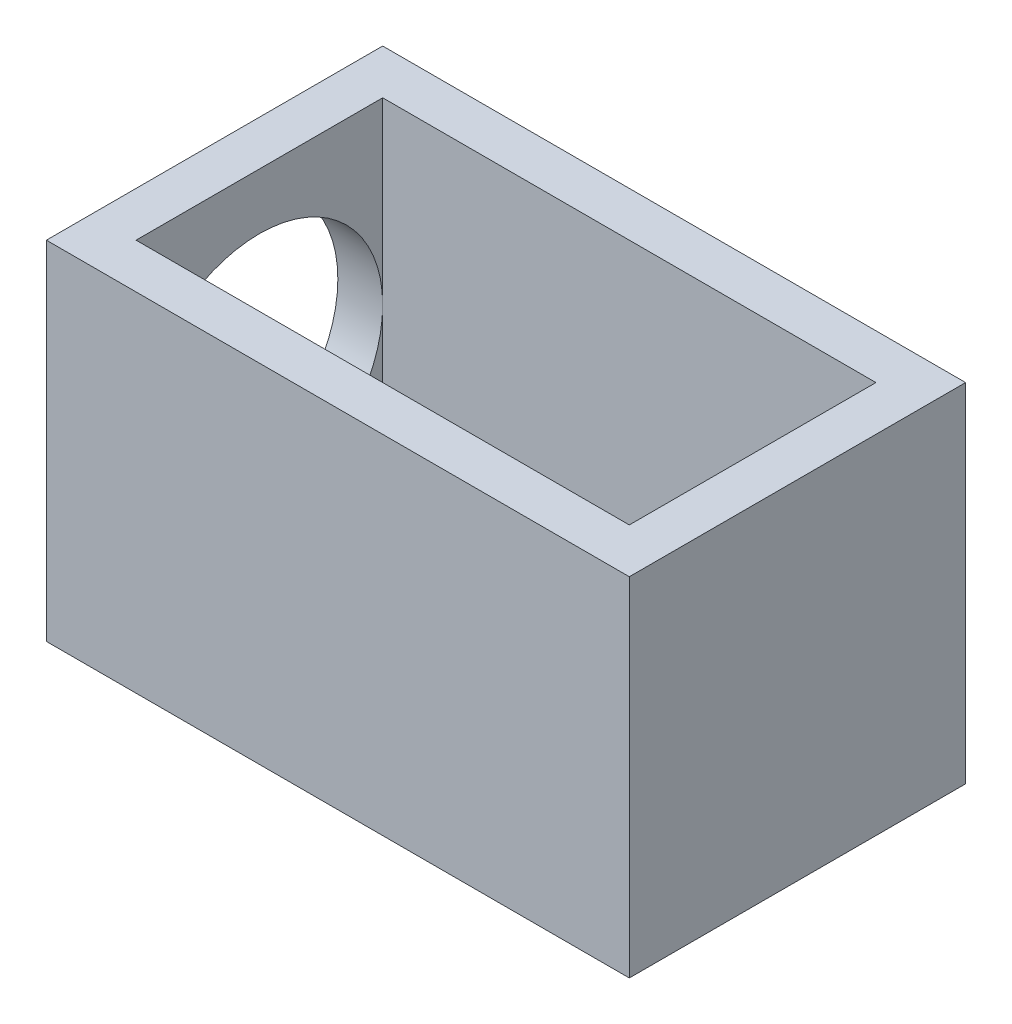
ISO-10303-21;
HEADER;
FILE_DESCRIPTION(('STEP AP214'),'2;1');
FILE_NAME('part.step','',(''),(''),'','','');
FILE_SCHEMA(('AUTOMOTIVE_DESIGN { 1 0 10303 214 1 1 1 1 }'));
ENDSEC;
DATA;
#1=APPLICATION_CONTEXT('core data for automotive mechanical design processes');
#2=APPLICATION_PROTOCOL_DEFINITION('international standard','automotive_design',2000,#1);
#3=PRODUCT_CONTEXT('',#1,'mechanical');
#4=PRODUCT('Part','Part','',(#3));
#5=PRODUCT_RELATED_PRODUCT_CATEGORY('part','',(#4));
#6=PRODUCT_DEFINITION_FORMATION('','',#4);
#7=PRODUCT_DEFINITION_CONTEXT('part definition',#1,'design');
#8=PRODUCT_DEFINITION('design','',#6,#7);
#9=PRODUCT_DEFINITION_SHAPE('','',#8);
#10=(LENGTH_UNIT() NAMED_UNIT(*) SI_UNIT(.MILLI.,.METRE.));
#11=(NAMED_UNIT(*) PLANE_ANGLE_UNIT() SI_UNIT($,.RADIAN.));
#12=(NAMED_UNIT(*) SI_UNIT($,.STERADIAN.) SOLID_ANGLE_UNIT());
#13=UNCERTAINTY_MEASURE_WITH_UNIT(LENGTH_MEASURE(1.E-05),#10,'distance_accuracy_value','');
#14=(GEOMETRIC_REPRESENTATION_CONTEXT(3) GLOBAL_UNCERTAINTY_ASSIGNED_CONTEXT((#13)) GLOBAL_UNIT_ASSIGNED_CONTEXT((#10,
#11,#12)) REPRESENTATION_CONTEXT('',''));
#15=CARTESIAN_POINT('',(0.,0.,0.));
#16=DIRECTION('',(0.,0.,1.));
#17=DIRECTION('',(1.,0.,0.));
#18=AXIS2_PLACEMENT_3D('',#15,#16,#17);
#19=CARTESIAN_POINT('',(5.5,7.75,-2.75));
#20=DIRECTION('',(-1.,0.,0.));
#21=DIRECTION('',(0.,0.,1.));
#22=AXIS2_PLACEMENT_3D('',#19,#20,#21);
#23=PLANE('',#22);
#24=DIRECTION('',(0.,-1.,0.));
#25=VECTOR('',#24,1.);
#26=CARTESIAN_POINT('',(5.5,7.75,-2.75));
#27=LINE('',#26,#25);
#28=CARTESIAN_POINT('',(5.5,7.75,-2.75));
#29=VERTEX_POINT('',#28);
#30=CARTESIAN_POINT('',(5.5,6.5,-2.75));
#31=VERTEX_POINT('',#30);
#32=EDGE_CURVE('E160',#29,#31,#27,.T.);
#33=ORIENTED_EDGE('',*,*,#32,.T.);
#34=DIRECTION('',(0.,0.,-1.));
#35=VECTOR('',#34,1.);
#36=CARTESIAN_POINT('',(5.5,6.5,3.));
#37=LINE('',#36,#35);
#38=CARTESIAN_POINT('',(5.5,6.5,2.75));
#39=VERTEX_POINT('',#38);
#40=EDGE_CURVE('E123',#39,#31,#37,.T.);
#41=ORIENTED_EDGE('',*,*,#40,.F.);
#42=DIRECTION('',(0.,-1.,0.));
#43=VECTOR('',#42,1.);
#44=CARTESIAN_POINT('',(5.5,7.75,2.75));
#45=LINE('',#44,#43);
#46=CARTESIAN_POINT('',(5.5,7.75,2.75));
#47=VERTEX_POINT('',#46);
#48=EDGE_CURVE('E122',#47,#39,#45,.T.);
#49=ORIENTED_EDGE('',*,*,#48,.F.);
#50=DIRECTION('',(0.,0.,-1.));
#51=VECTOR('',#50,1.);
#52=CARTESIAN_POINT('',(5.5,7.75,-2.75));
#53=LINE('',#52,#51);
#54=EDGE_CURVE('E141',#47,#29,#53,.T.);
#55=ORIENTED_EDGE('',*,*,#54,.T.);
#56=EDGE_LOOP('',(#33,#41,#49,#55));
#57=FACE_BOUND('',#56,.T.);
#58=ADVANCED_FACE('F33',(#57),#23,.T.);
#59=CARTESIAN_POINT('',(-5.5,7.75,-2.75));
#60=DIRECTION('',(0.,0.,1.));
#61=DIRECTION('',(1.,0.,0.));
#62=AXIS2_PLACEMENT_3D('',#59,#60,#61);
#63=PLANE('',#62);
#64=DIRECTION('',(-1.,0.,0.));
#65=VECTOR('',#64,1.);
#66=CARTESIAN_POINT('',(-5.5,1.,-2.75));
#67=LINE('',#66,#65);
#68=CARTESIAN_POINT('',(2.25,1.,-2.75));
#69=VERTEX_POINT('',#68);
#70=CARTESIAN_POINT('',(-5.5,1.,-2.75));
#71=VERTEX_POINT('',#70);
#72=EDGE_CURVE('E54',#69,#71,#67,.T.);
#73=ORIENTED_EDGE('',*,*,#72,.F.);
#74=DIRECTION('',(0.508729312126641,0.860926528214316,0.));
#75=VECTOR('',#74,1.);
#76=CARTESIAN_POINT('',(3.20061255742726,2.60872894333844,-2.75));
#77=LINE('',#76,#75);
#78=EDGE_CURVE('E48',#69,#31,#77,.T.);
#79=ORIENTED_EDGE('',*,*,#78,.T.);
#80=ORIENTED_EDGE('',*,*,#32,.F.);
#81=DIRECTION('',(-1.,0.,0.));
#82=VECTOR('',#81,1.);
#83=CARTESIAN_POINT('',(-5.5,7.75,-2.75));
#84=LINE('',#83,#82);
#85=CARTESIAN_POINT('',(-5.5,7.75,-2.75));
#86=VERTEX_POINT('',#85);
#87=EDGE_CURVE('E144',#29,#86,#84,.T.);
#88=ORIENTED_EDGE('',*,*,#87,.T.);
#89=DIRECTION('',(0.,-1.,0.));
#90=VECTOR('',#89,1.);
#91=CARTESIAN_POINT('',(-5.5,7.75,-2.75));
#92=LINE('',#91,#90);
#93=CARTESIAN_POINT('',(-5.5,3.75,-2.75));
#94=VERTEX_POINT('',#93);
#95=EDGE_CURVE('E157',#86,#94,#92,.T.);
#96=ORIENTED_EDGE('',*,*,#95,.T.);
#97=EDGE_CURVE('E156',#94,#71,#92,.T.);
#98=ORIENTED_EDGE('',*,*,#97,.T.);
#99=EDGE_LOOP('',(#73,#79,#80,#88,#96,#98));
#100=FACE_BOUND('',#99,.T.);
#101=ADVANCED_FACE('F222',(#100),#63,.T.);
#102=CARTESIAN_POINT('',(-5.5,7.75,2.75));
#103=DIRECTION('',(0.,0.,-1.));
#104=DIRECTION('',(-1.,0.,0.));
#105=AXIS2_PLACEMENT_3D('',#102,#103,#104);
#106=PLANE('',#105);
#107=ORIENTED_EDGE('',*,*,#48,.T.);
#108=DIRECTION('',(-0.508729312126641,-0.860926528214316,0.));
#109=VECTOR('',#108,1.);
#110=CARTESIAN_POINT('',(3.20061255742726,2.60872894333844,2.75));
#111=LINE('',#110,#109);
#112=CARTESIAN_POINT('',(2.25,1.,2.75));
#113=VERTEX_POINT('',#112);
#114=EDGE_CURVE('E112',#39,#113,#111,.T.);
#115=ORIENTED_EDGE('',*,*,#114,.T.);
#116=DIRECTION('',(1.,0.,0.));
#117=VECTOR('',#116,1.);
#118=CARTESIAN_POINT('',(-5.5,1.,2.75));
#119=LINE('',#118,#117);
#120=CARTESIAN_POINT('',(-5.5,1.,2.75));
#121=VERTEX_POINT('',#120);
#122=EDGE_CURVE('E119',#121,#113,#119,.T.);
#123=ORIENTED_EDGE('',*,*,#122,.F.);
#124=DIRECTION('',(0.,-1.,0.));
#125=VECTOR('',#124,1.);
#126=CARTESIAN_POINT('',(-5.5,7.75,2.75));
#127=LINE('',#126,#125);
#128=CARTESIAN_POINT('',(-5.5,3.75,2.75));
#129=VERTEX_POINT('',#128);
#130=EDGE_CURVE('E152',#129,#121,#127,.T.);
#131=ORIENTED_EDGE('',*,*,#130,.F.);
#132=CARTESIAN_POINT('',(-5.5,7.75,2.75));
#133=VERTEX_POINT('',#132);
#134=EDGE_CURVE('E153',#133,#129,#127,.T.);
#135=ORIENTED_EDGE('',*,*,#134,.F.);
#136=DIRECTION('',(1.,0.,0.));
#137=VECTOR('',#136,1.);
#138=CARTESIAN_POINT('',(-5.5,7.75,2.75));
#139=LINE('',#138,#137);
#140=EDGE_CURVE('E149',#133,#47,#139,.T.);
#141=ORIENTED_EDGE('',*,*,#140,.T.);
#142=EDGE_LOOP('',(#107,#115,#123,#131,#135,#141));
#143=FACE_BOUND('',#142,.T.);
#144=ADVANCED_FACE('F117',(#143),#106,.T.);
#145=CARTESIAN_POINT('',(0.,1.,0.));
#146=DIRECTION('',(0.,1.,0.));
#147=DIRECTION('',(0.,0.,1.));
#148=AXIS2_PLACEMENT_3D('',#145,#146,#147);
#149=PLANE('',#148);
#150=ORIENTED_EDGE('',*,*,#122,.T.);
#151=DIRECTION('',(0.,0.,-1.));
#152=VECTOR('',#151,1.);
#153=CARTESIAN_POINT('',(2.25,1.,0.));
#154=LINE('',#153,#152);
#155=EDGE_CURVE('E11',#113,#69,#154,.T.);
#156=ORIENTED_EDGE('',*,*,#155,.T.);
#157=ORIENTED_EDGE('',*,*,#72,.T.);
#158=DIRECTION('',(0.,0.,1.));
#159=VECTOR('',#158,1.);
#160=CARTESIAN_POINT('',(-5.5,1.,-2.75));
#161=LINE('',#160,#159);
#162=CARTESIAN_POINT('',(-5.5,1.,0.));
#163=VERTEX_POINT('',#162);
#164=EDGE_CURVE('E129',#71,#163,#161,.T.);
#165=ORIENTED_EDGE('',*,*,#164,.T.);
#166=EDGE_CURVE('E127',#163,#121,#161,.T.);
#167=ORIENTED_EDGE('',*,*,#166,.T.);
#168=EDGE_LOOP('',(#150,#156,#157,#165,#167));
#169=FACE_BOUND('',#168,.T.);
#170=ADVANCED_FACE('F126',(#169),#149,.T.);
#171=CARTESIAN_POINT('',(-5.5,7.75,-2.75));
#172=DIRECTION('',(1.,0.,0.));
#173=DIRECTION('',(0.,0.,-1.));
#174=AXIS2_PLACEMENT_3D('',#171,#172,#173);
#175=PLANE('',#174);
#176=ORIENTED_EDGE('',*,*,#164,.F.);
#177=ORIENTED_EDGE('',*,*,#97,.F.);
#178=CARTESIAN_POINT('',(-5.5,3.75,0.));
#179=DIRECTION('',(1.,0.,0.));
#180=DIRECTION('',(0.,0.,-1.));
#181=AXIS2_PLACEMENT_3D('',#178,#179,#180);
#182=CIRCLE('',#181,2.75);
#183=EDGE_CURVE('E138',#94,#163,#182,.F.);
#184=ORIENTED_EDGE('',*,*,#183,.T.);
#185=EDGE_LOOP('',(#176,#177,#184));
#186=FACE_BOUND('',#185,.T.);
#187=ADVANCED_FACE('F231',(#186),#175,.T.);
#188=EDGE_CURVE('E137',#129,#94,#182,.F.);
#189=ORIENTED_EDGE('',*,*,#188,.T.);
#190=ORIENTED_EDGE('',*,*,#95,.F.);
#191=DIRECTION('',(0.,0.,1.));
#192=VECTOR('',#191,1.);
#193=CARTESIAN_POINT('',(-5.5,7.75,-2.75));
#194=LINE('',#193,#192);
#195=EDGE_CURVE('E146',#86,#133,#194,.T.);
#196=ORIENTED_EDGE('',*,*,#195,.T.);
#197=ORIENTED_EDGE('',*,*,#134,.T.);
#198=EDGE_LOOP('',(#189,#190,#196,#197));
#199=FACE_BOUND('',#198,.T.);
#200=ADVANCED_FACE('F213',(#199),#175,.T.);
#201=CARTESIAN_POINT('',(0.,7.75,0.));
#202=DIRECTION('',(0.,1.,0.));
#203=DIRECTION('',(0.,0.,1.));
#204=AXIS2_PLACEMENT_3D('',#201,#202,#203);
#205=PLANE('',#204);
#206=DIRECTION('',(0.,0.,1.));
#207=VECTOR('',#206,1.);
#208=CARTESIAN_POINT('',(-6.5,7.75,-3.75));
#209=LINE('',#208,#207);
#210=CARTESIAN_POINT('',(-6.5,7.75,-3.75));
#211=VERTEX_POINT('',#210);
#212=CARTESIAN_POINT('',(-6.5,7.75,3.75));
#213=VERTEX_POINT('',#212);
#214=EDGE_CURVE('E164',#211,#213,#209,.T.);
#215=ORIENTED_EDGE('',*,*,#214,.T.);
#216=DIRECTION('',(1.,0.,0.));
#217=VECTOR('',#216,1.);
#218=CARTESIAN_POINT('',(-6.5,7.75,3.75));
#219=LINE('',#218,#217);
#220=CARTESIAN_POINT('',(6.5,7.75,3.75));
#221=VERTEX_POINT('',#220);
#222=EDGE_CURVE('E167',#213,#221,#219,.T.);
#223=ORIENTED_EDGE('',*,*,#222,.T.);
#224=DIRECTION('',(0.,0.,-1.));
#225=VECTOR('',#224,1.);
#226=CARTESIAN_POINT('',(6.5,7.75,-3.75));
#227=LINE('',#226,#225);
#228=CARTESIAN_POINT('',(6.5,7.75,-3.75));
#229=VERTEX_POINT('',#228);
#230=EDGE_CURVE('E170',#221,#229,#227,.T.);
#231=ORIENTED_EDGE('',*,*,#230,.T.);
#232=DIRECTION('',(-1.,0.,0.));
#233=VECTOR('',#232,1.);
#234=CARTESIAN_POINT('',(-6.5,7.75,-3.75));
#235=LINE('',#234,#233);
#236=EDGE_CURVE('E172',#229,#211,#235,.T.);
#237=ORIENTED_EDGE('',*,*,#236,.T.);
#238=EDGE_LOOP('',(#215,#223,#231,#237));
#239=FACE_BOUND('',#238,.T.);
#240=ORIENTED_EDGE('',*,*,#87,.F.);
#241=ORIENTED_EDGE('',*,*,#54,.F.);
#242=ORIENTED_EDGE('',*,*,#140,.F.);
#243=ORIENTED_EDGE('',*,*,#195,.F.);
#244=EDGE_LOOP('',(#240,#241,#242,#243));
#245=FACE_BOUND('',#244,.T.);
#246=ADVANCED_FACE('F210',(#239,#245),#205,.T.);
#247=CARTESIAN_POINT('',(0.,0.,0.));
#248=DIRECTION('',(0.,1.,0.));
#249=DIRECTION('',(0.,0.,1.));
#250=AXIS2_PLACEMENT_3D('',#247,#248,#249);
#251=PLANE('',#250);
#252=DIRECTION('',(0.,0.,1.));
#253=VECTOR('',#252,1.);
#254=CARTESIAN_POINT('',(-6.5,0.,-3.75));
#255=LINE('',#254,#253);
#256=CARTESIAN_POINT('',(-6.5,0.,-3.75));
#257=VERTEX_POINT('',#256);
#258=CARTESIAN_POINT('',(-6.5,0.,3.75));
#259=VERTEX_POINT('',#258);
#260=EDGE_CURVE('E163',#257,#259,#255,.T.);
#261=ORIENTED_EDGE('',*,*,#260,.F.);
#262=DIRECTION('',(-1.,0.,0.));
#263=VECTOR('',#262,1.);
#264=CARTESIAN_POINT('',(-6.5,0.,-3.75));
#265=LINE('',#264,#263);
#266=CARTESIAN_POINT('',(6.5,0.,-3.75));
#267=VERTEX_POINT('',#266);
#268=EDGE_CURVE('E168',#267,#257,#265,.T.);
#269=ORIENTED_EDGE('',*,*,#268,.F.);
#270=DIRECTION('',(0.,0.,-1.));
#271=VECTOR('',#270,1.);
#272=CARTESIAN_POINT('',(6.5,0.,-3.75));
#273=LINE('',#272,#271);
#274=CARTESIAN_POINT('',(6.5,0.,3.75));
#275=VERTEX_POINT('',#274);
#276=EDGE_CURVE('E180',#275,#267,#273,.T.);
#277=ORIENTED_EDGE('',*,*,#276,.F.);
#278=DIRECTION('',(1.,0.,0.));
#279=VECTOR('',#278,1.);
#280=CARTESIAN_POINT('',(-6.5,0.,3.75));
#281=LINE('',#280,#279);
#282=EDGE_CURVE('E177',#259,#275,#281,.T.);
#283=ORIENTED_EDGE('',*,*,#282,.F.);
#284=EDGE_LOOP('',(#261,#269,#277,#283));
#285=FACE_BOUND('',#284,.T.);
#286=ADVANCED_FACE('F199',(#285),#251,.F.);
#287=CARTESIAN_POINT('',(-6.5,7.75,-3.75));
#288=DIRECTION('',(1.,0.,0.));
#289=DIRECTION('',(0.,0.,-1.));
#290=AXIS2_PLACEMENT_3D('',#287,#288,#289);
#291=PLANE('',#290);
#292=CARTESIAN_POINT('',(-6.5,3.75,0.));
#293=DIRECTION('',(-1.,0.,0.));
#294=DIRECTION('',(0.,0.,1.));
#295=AXIS2_PLACEMENT_3D('',#292,#293,#294);
#296=CIRCLE('',#295,2.75);
#297=CARTESIAN_POINT('',(-6.5,3.75,2.75));
#298=VERTEX_POINT('',#297);
#299=EDGE_CURVE('E134',#298,#298,#296,.T.);
#300=ORIENTED_EDGE('',*,*,#299,.F.);
#301=EDGE_LOOP('',(#300));
#302=FACE_BOUND('',#301,.T.);
#303=DIRECTION('',(0.,-1.,0.));
#304=VECTOR('',#303,1.);
#305=CARTESIAN_POINT('',(-6.5,7.75,-3.75));
#306=LINE('',#305,#304);
#307=EDGE_CURVE('E174',#211,#257,#306,.T.);
#308=ORIENTED_EDGE('',*,*,#307,.T.);
#309=ORIENTED_EDGE('',*,*,#260,.T.);
#310=DIRECTION('',(0.,-1.,0.));
#311=VECTOR('',#310,1.);
#312=CARTESIAN_POINT('',(-6.5,7.75,3.75));
#313=LINE('',#312,#311);
#314=EDGE_CURVE('E41',#213,#259,#313,.T.);
#315=ORIENTED_EDGE('',*,*,#314,.F.);
#316=ORIENTED_EDGE('',*,*,#214,.F.);
#317=EDGE_LOOP('',(#308,#309,#315,#316));
#318=FACE_BOUND('',#317,.T.);
#319=ADVANCED_FACE('F35',(#302,#318),#291,.F.);
#320=CARTESIAN_POINT('',(-6.5,7.75,3.75));
#321=DIRECTION('',(0.,0.,-1.));
#322=DIRECTION('',(-1.,0.,0.));
#323=AXIS2_PLACEMENT_3D('',#320,#321,#322);
#324=PLANE('',#323);
#325=ORIENTED_EDGE('',*,*,#314,.T.);
#326=ORIENTED_EDGE('',*,*,#282,.T.);
#327=DIRECTION('',(0.,-1.,0.));
#328=VECTOR('',#327,1.);
#329=CARTESIAN_POINT('',(6.5,7.75,3.75));
#330=LINE('',#329,#328);
#331=EDGE_CURVE('E188',#221,#275,#330,.T.);
#332=ORIENTED_EDGE('',*,*,#331,.F.);
#333=ORIENTED_EDGE('',*,*,#222,.F.);
#334=EDGE_LOOP('',(#325,#326,#332,#333));
#335=FACE_BOUND('',#334,.T.);
#336=ADVANCED_FACE('F192',(#335),#324,.F.);
#337=CARTESIAN_POINT('',(6.5,7.75,-3.75));
#338=DIRECTION('',(-1.,0.,0.));
#339=DIRECTION('',(0.,0.,1.));
#340=AXIS2_PLACEMENT_3D('',#337,#338,#339);
#341=PLANE('',#340);
#342=ORIENTED_EDGE('',*,*,#331,.T.);
#343=ORIENTED_EDGE('',*,*,#276,.T.);
#344=DIRECTION('',(0.,-1.,0.));
#345=VECTOR('',#344,1.);
#346=CARTESIAN_POINT('',(6.5,7.75,-3.75));
#347=LINE('',#346,#345);
#348=EDGE_CURVE('E186',#229,#267,#347,.T.);
#349=ORIENTED_EDGE('',*,*,#348,.F.);
#350=ORIENTED_EDGE('',*,*,#230,.F.);
#351=EDGE_LOOP('',(#342,#343,#349,#350));
#352=FACE_BOUND('',#351,.T.);
#353=ADVANCED_FACE('F208',(#352),#341,.F.);
#354=CARTESIAN_POINT('',(-6.5,7.75,-3.75));
#355=DIRECTION('',(0.,0.,1.));
#356=DIRECTION('',(1.,0.,0.));
#357=AXIS2_PLACEMENT_3D('',#354,#355,#356);
#358=PLANE('',#357);
#359=ORIENTED_EDGE('',*,*,#348,.T.);
#360=ORIENTED_EDGE('',*,*,#268,.T.);
#361=ORIENTED_EDGE('',*,*,#307,.F.);
#362=ORIENTED_EDGE('',*,*,#236,.F.);
#363=EDGE_LOOP('',(#359,#360,#361,#362));
#364=FACE_BOUND('',#363,.T.);
#365=ADVANCED_FACE('F204',(#364),#358,.F.);
#366=ORIENTED_EDGE('',*,*,#166,.F.);
#367=EDGE_CURVE('E142',#163,#129,#182,.F.);
#368=ORIENTED_EDGE('',*,*,#367,.T.);
#369=ORIENTED_EDGE('',*,*,#130,.T.);
#370=EDGE_LOOP('',(#366,#368,#369));
#371=FACE_BOUND('',#370,.T.);
#372=ADVANCED_FACE('F246',(#371),#175,.T.);
#373=CARTESIAN_POINT('',(2.27817459305202,3.75,0.));
#374=DIRECTION('',(-1.,0.,0.));
#375=DIRECTION('',(0.,0.,1.));
#376=AXIS2_PLACEMENT_3D('',#373,#374,#375);
#377=CYLINDRICAL_SURFACE('',#376,2.75);
#378=ORIENTED_EDGE('',*,*,#367,.F.);
#379=ORIENTED_EDGE('',*,*,#183,.F.);
#380=ORIENTED_EDGE('',*,*,#188,.F.);
#381=EDGE_LOOP('',(#378,#379,#380));
#382=FACE_BOUND('',#381,.T.);
#383=ORIENTED_EDGE('',*,*,#299,.T.);
#384=EDGE_LOOP('',(#383));
#385=FACE_BOUND('',#384,.T.);
#386=ADVANCED_FACE('F257',(#382,#385),#377,.F.);
#387=CARTESIAN_POINT('',(2.25,1.,3.));
#388=DIRECTION('',(0.860926528214316,-0.508729312126641,0.));
#389=DIRECTION('',(0.508729312126641,0.860926528214316,0.));
#390=AXIS2_PLACEMENT_3D('',#387,#388,#389);
#391=PLANE('',#390);
#392=ORIENTED_EDGE('',*,*,#78,.F.);
#393=ORIENTED_EDGE('',*,*,#155,.F.);
#394=ORIENTED_EDGE('',*,*,#114,.F.);
#395=ORIENTED_EDGE('',*,*,#40,.T.);
#396=EDGE_LOOP('',(#392,#393,#394,#395));
#397=FACE_BOUND('',#396,.T.);
#398=ADVANCED_FACE('F111',(#397),#391,.F.);
#399=CLOSED_SHELL('',(#58,#101,#144,#170,#187,#200,#246,#286,#319,#336,#353,#365,#372,#386,#398));
#400=MANIFOLD_SOLID_BREP('B2',#399);
#401=ADVANCED_BREP_SHAPE_REPRESENTATION('',(#18,#400),#14);
#402=SHAPE_DEFINITION_REPRESENTATION(#9,#401);
ENDSEC;
END-ISO-10303-21;
